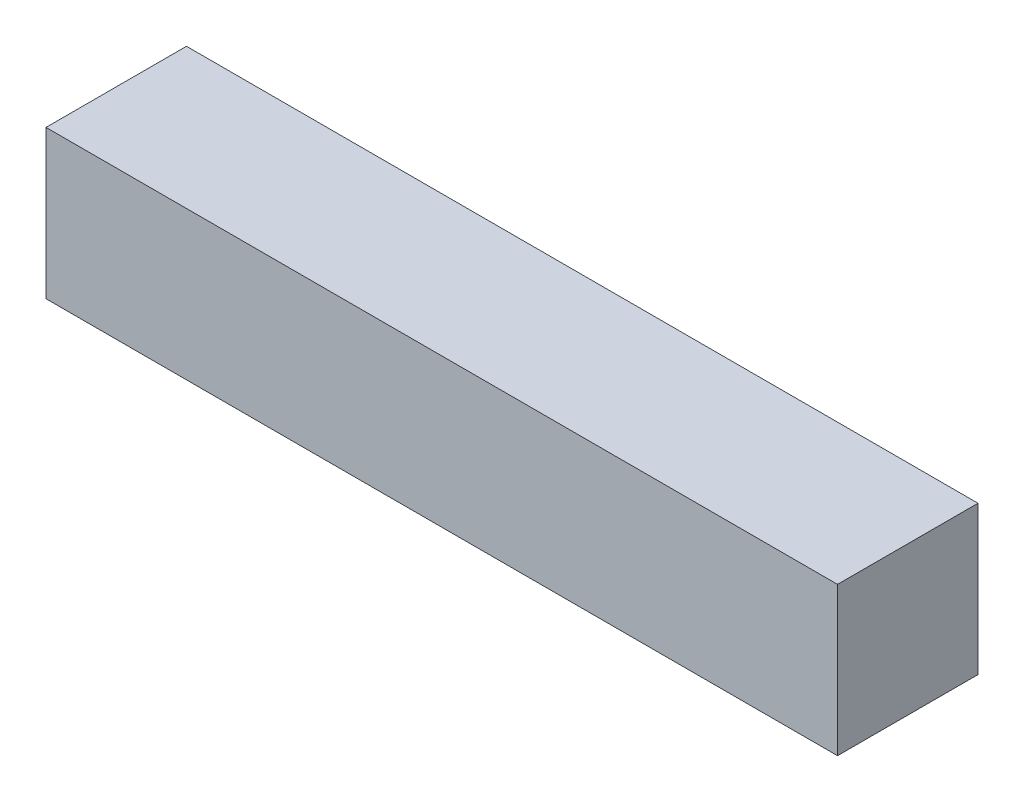
ISO-10303-21;
HEADER;
FILE_DESCRIPTION(('STEP AP214'),'2;1');
FILE_NAME('part.step','',(''),(''),'','','');
FILE_SCHEMA(('AUTOMOTIVE_DESIGN { 1 0 10303 214 1 1 1 1 }'));
ENDSEC;
DATA;
#1=APPLICATION_CONTEXT('core data for automotive mechanical design processes');
#2=APPLICATION_PROTOCOL_DEFINITION('international standard','automotive_design',2000,#1);
#3=PRODUCT_CONTEXT('',#1,'mechanical');
#4=PRODUCT('Part','Part','',(#3));
#5=PRODUCT_RELATED_PRODUCT_CATEGORY('part','',(#4));
#6=PRODUCT_DEFINITION_FORMATION('','',#4);
#7=PRODUCT_DEFINITION_CONTEXT('part definition',#1,'design');
#8=PRODUCT_DEFINITION('design','',#6,#7);
#9=PRODUCT_DEFINITION_SHAPE('','',#8);
#10=(LENGTH_UNIT() NAMED_UNIT(*) SI_UNIT(.MILLI.,.METRE.));
#11=(NAMED_UNIT(*) PLANE_ANGLE_UNIT() SI_UNIT($,.RADIAN.));
#12=(NAMED_UNIT(*) SI_UNIT($,.STERADIAN.) SOLID_ANGLE_UNIT());
#13=UNCERTAINTY_MEASURE_WITH_UNIT(LENGTH_MEASURE(1.E-05),#10,'distance_accuracy_value','');
#14=(GEOMETRIC_REPRESENTATION_CONTEXT(3) GLOBAL_UNCERTAINTY_ASSIGNED_CONTEXT((#13)) GLOBAL_UNIT_ASSIGNED_CONTEXT((#10,
#11,#12)) REPRESENTATION_CONTEXT('',''));
#15=CARTESIAN_POINT('',(0.,0.,0.));
#16=DIRECTION('',(0.,0.,1.));
#17=DIRECTION('',(1.,0.,0.));
#18=AXIS2_PLACEMENT_3D('',#15,#16,#17);
#19=CARTESIAN_POINT('',(-101.6,38.1,18.034));
#20=DIRECTION('',(-1.,0.,0.));
#21=DIRECTION('',(0.,0.,1.));
#22=AXIS2_PLACEMENT_3D('',#19,#20,#21);
#23=PLANE('',#22);
#24=DIRECTION('',(0.,0.,-1.));
#25=VECTOR('',#24,1.);
#26=CARTESIAN_POINT('',(-101.6,0.,18.034));
#27=LINE('',#26,#25);
#28=CARTESIAN_POINT('',(-101.6,0.,18.034));
#29=VERTEX_POINT('',#28);
#30=CARTESIAN_POINT('',(-101.6,0.,-18.034));
#31=VERTEX_POINT('',#30);
#32=EDGE_CURVE('E98',#29,#31,#27,.T.);
#33=ORIENTED_EDGE('',*,*,#32,.F.);
#34=DIRECTION('',(0.,-1.,0.));
#35=VECTOR('',#34,1.);
#36=CARTESIAN_POINT('',(-101.6,38.1,18.034));
#37=LINE('',#36,#35);
#38=CARTESIAN_POINT('',(-101.6,38.1,18.034));
#39=VERTEX_POINT('',#38);
#40=EDGE_CURVE('E11',#39,#29,#37,.T.);
#41=ORIENTED_EDGE('',*,*,#40,.F.);
#42=DIRECTION('',(0.,0.,-1.));
#43=VECTOR('',#42,1.);
#44=CARTESIAN_POINT('',(-101.6,38.1,18.034));
#45=LINE('',#44,#43);
#46=CARTESIAN_POINT('',(-101.6,38.1,-18.034));
#47=VERTEX_POINT('',#46);
#48=EDGE_CURVE('E93',#39,#47,#45,.T.);
#49=ORIENTED_EDGE('',*,*,#48,.T.);
#50=DIRECTION('',(0.,-1.,0.));
#51=VECTOR('',#50,1.);
#52=CARTESIAN_POINT('',(-101.6,38.1,-18.034));
#53=LINE('',#52,#51);
#54=EDGE_CURVE('E36',#47,#31,#53,.T.);
#55=ORIENTED_EDGE('',*,*,#54,.T.);
#56=EDGE_LOOP('',(#33,#41,#49,#55));
#57=FACE_BOUND('',#56,.T.);
#58=ADVANCED_FACE('F33',(#57),#23,.T.);
#59=CARTESIAN_POINT('',(-101.6,38.1,18.034));
#60=DIRECTION('',(0.,0.,-1.));
#61=DIRECTION('',(-1.,0.,0.));
#62=AXIS2_PLACEMENT_3D('',#59,#60,#61);
#63=PLANE('',#62);
#64=DIRECTION('',(1.,0.,0.));
#65=VECTOR('',#64,1.);
#66=CARTESIAN_POINT('',(-101.6,0.,18.034));
#67=LINE('',#66,#65);
#68=CARTESIAN_POINT('',(101.6,0.,18.034));
#69=VERTEX_POINT('',#68);
#70=EDGE_CURVE('E66',#29,#69,#67,.T.);
#71=ORIENTED_EDGE('',*,*,#70,.T.);
#72=DIRECTION('',(0.,-1.,0.));
#73=VECTOR('',#72,1.);
#74=CARTESIAN_POINT('',(101.6,38.1,18.034));
#75=LINE('',#74,#73);
#76=CARTESIAN_POINT('',(101.6,38.1,18.034));
#77=VERTEX_POINT('',#76);
#78=EDGE_CURVE('E42',#77,#69,#75,.T.);
#79=ORIENTED_EDGE('',*,*,#78,.F.);
#80=DIRECTION('',(1.,0.,0.));
#81=VECTOR('',#80,1.);
#82=CARTESIAN_POINT('',(-101.6,38.1,18.034));
#83=LINE('',#82,#81);
#84=EDGE_CURVE('E83',#39,#77,#83,.T.);
#85=ORIENTED_EDGE('',*,*,#84,.F.);
#86=ORIENTED_EDGE('',*,*,#40,.T.);
#87=EDGE_LOOP('',(#71,#79,#85,#86));
#88=FACE_BOUND('',#87,.T.);
#89=ADVANCED_FACE('F108',(#88),#63,.F.);
#90=CARTESIAN_POINT('',(101.6,38.1,18.034));
#91=DIRECTION('',(-1.,0.,0.));
#92=DIRECTION('',(0.,0.,1.));
#93=AXIS2_PLACEMENT_3D('',#90,#91,#92);
#94=PLANE('',#93);
#95=DIRECTION('',(0.,0.,-1.));
#96=VECTOR('',#95,1.);
#97=CARTESIAN_POINT('',(101.6,0.,18.034));
#98=LINE('',#97,#96);
#99=CARTESIAN_POINT('',(101.6,0.,-18.034));
#100=VERTEX_POINT('',#99);
#101=EDGE_CURVE('E90',#69,#100,#98,.T.);
#102=ORIENTED_EDGE('',*,*,#101,.T.);
#103=DIRECTION('',(0.,-1.,0.));
#104=VECTOR('',#103,1.);
#105=CARTESIAN_POINT('',(101.6,38.1,-18.034));
#106=LINE('',#105,#104);
#107=CARTESIAN_POINT('',(101.6,38.1,-18.034));
#108=VERTEX_POINT('',#107);
#109=EDGE_CURVE('E87',#108,#100,#106,.T.);
#110=ORIENTED_EDGE('',*,*,#109,.F.);
#111=DIRECTION('',(0.,0.,-1.));
#112=VECTOR('',#111,1.);
#113=CARTESIAN_POINT('',(101.6,38.1,18.034));
#114=LINE('',#113,#112);
#115=EDGE_CURVE('E78',#77,#108,#114,.T.);
#116=ORIENTED_EDGE('',*,*,#115,.F.);
#117=ORIENTED_EDGE('',*,*,#78,.T.);
#118=EDGE_LOOP('',(#102,#110,#116,#117));
#119=FACE_BOUND('',#118,.T.);
#120=ADVANCED_FACE('F88',(#119),#94,.F.);
#121=CARTESIAN_POINT('',(-101.6,38.1,-18.034));
#122=DIRECTION('',(0.,0.,-1.));
#123=DIRECTION('',(-1.,0.,0.));
#124=AXIS2_PLACEMENT_3D('',#121,#122,#123);
#125=PLANE('',#124);
#126=DIRECTION('',(1.,0.,0.));
#127=VECTOR('',#126,1.);
#128=CARTESIAN_POINT('',(-101.6,0.,-18.034));
#129=LINE('',#128,#127);
#130=EDGE_CURVE('E101',#31,#100,#129,.T.);
#131=ORIENTED_EDGE('',*,*,#130,.F.);
#132=ORIENTED_EDGE('',*,*,#54,.F.);
#133=DIRECTION('',(1.,0.,0.));
#134=VECTOR('',#133,1.);
#135=CARTESIAN_POINT('',(-101.6,38.1,-18.034));
#136=LINE('',#135,#134);
#137=EDGE_CURVE('E82',#47,#108,#136,.T.);
#138=ORIENTED_EDGE('',*,*,#137,.T.);
#139=ORIENTED_EDGE('',*,*,#109,.T.);
#140=EDGE_LOOP('',(#131,#132,#138,#139));
#141=FACE_BOUND('',#140,.T.);
#142=ADVANCED_FACE('F92',(#141),#125,.T.);
#143=CARTESIAN_POINT('',(0.,38.1,0.));
#144=DIRECTION('',(0.,-1.,0.));
#145=DIRECTION('',(0.,0.,-1.));
#146=AXIS2_PLACEMENT_3D('',#143,#144,#145);
#147=PLANE('',#146);
#148=ORIENTED_EDGE('',*,*,#48,.F.);
#149=ORIENTED_EDGE('',*,*,#84,.T.);
#150=ORIENTED_EDGE('',*,*,#115,.T.);
#151=ORIENTED_EDGE('',*,*,#137,.F.);
#152=EDGE_LOOP('',(#148,#149,#150,#151));
#153=FACE_BOUND('',#152,.T.);
#154=ADVANCED_FACE('F81',(#153),#147,.F.);
#155=CARTESIAN_POINT('',(0.,0.,0.));
#156=DIRECTION('',(0.,-1.,0.));
#157=DIRECTION('',(0.,0.,-1.));
#158=AXIS2_PLACEMENT_3D('',#155,#156,#157);
#159=PLANE('',#158);
#160=ORIENTED_EDGE('',*,*,#32,.T.);
#161=ORIENTED_EDGE('',*,*,#130,.T.);
#162=ORIENTED_EDGE('',*,*,#101,.F.);
#163=ORIENTED_EDGE('',*,*,#70,.F.);
#164=EDGE_LOOP('',(#160,#161,#162,#163));
#165=FACE_BOUND('',#164,.T.);
#166=ADVANCED_FACE('F106',(#165),#159,.T.);
#167=CLOSED_SHELL('',(#58,#89,#120,#142,#154,#166));
#168=MANIFOLD_SOLID_BREP('B2',#167);
#169=ADVANCED_BREP_SHAPE_REPRESENTATION('',(#18,#168),#14);
#170=SHAPE_DEFINITION_REPRESENTATION(#9,#169);
ENDSEC;
END-ISO-10303-21;
